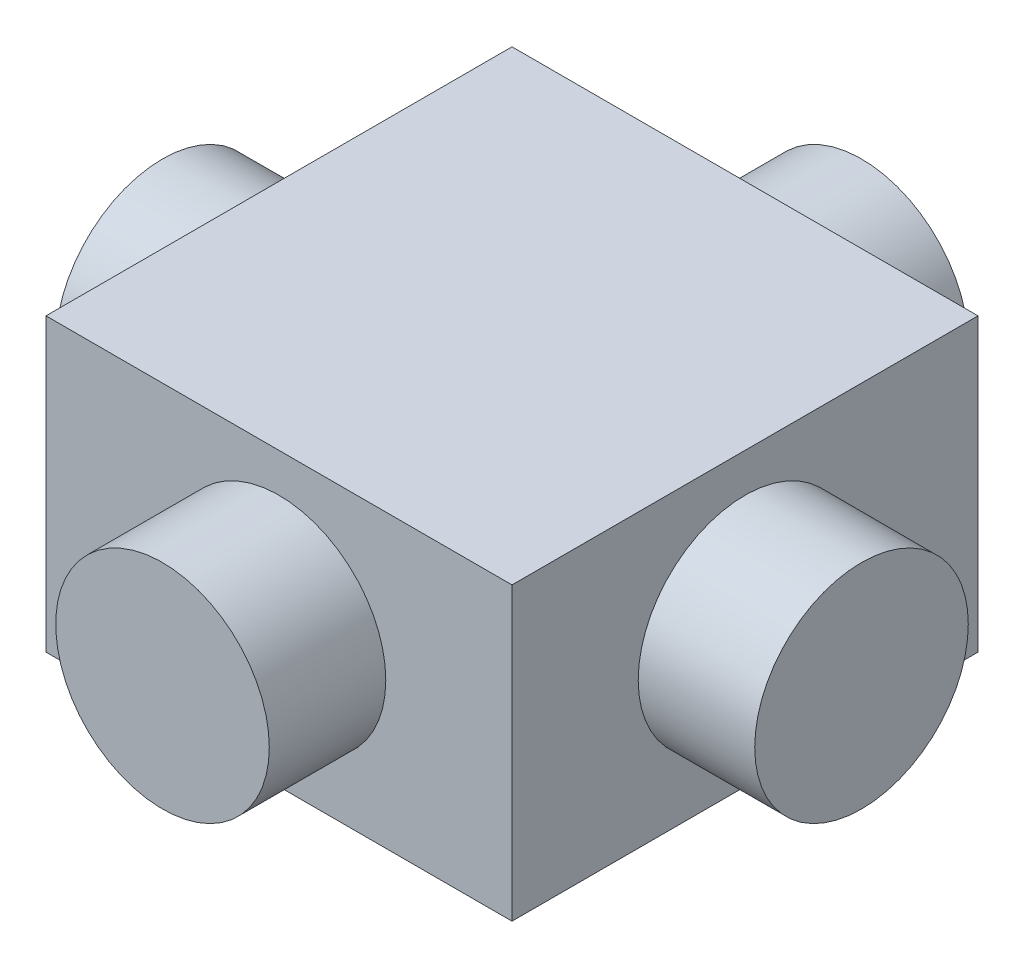
ISO-10303-21;
HEADER;
FILE_DESCRIPTION(('STEP AP214'),'2;1');
FILE_NAME('part.step','',(''),(''),'','','');
FILE_SCHEMA(('AUTOMOTIVE_DESIGN { 1 0 10303 214 1 1 1 1 }'));
ENDSEC;
DATA;
#1=APPLICATION_CONTEXT('core data for automotive mechanical design processes');
#2=APPLICATION_PROTOCOL_DEFINITION('international standard','automotive_design',2000,#1);
#3=PRODUCT_CONTEXT('',#1,'mechanical');
#4=PRODUCT('Part','Part','',(#3));
#5=PRODUCT_RELATED_PRODUCT_CATEGORY('part','',(#4));
#6=PRODUCT_DEFINITION_FORMATION('','',#4);
#7=PRODUCT_DEFINITION_CONTEXT('part definition',#1,'design');
#8=PRODUCT_DEFINITION('design','',#6,#7);
#9=PRODUCT_DEFINITION_SHAPE('','',#8);
#10=(LENGTH_UNIT() NAMED_UNIT(*) SI_UNIT(.MILLI.,.METRE.));
#11=(NAMED_UNIT(*) PLANE_ANGLE_UNIT() SI_UNIT($,.RADIAN.));
#12=(NAMED_UNIT(*) SI_UNIT($,.STERADIAN.) SOLID_ANGLE_UNIT());
#13=UNCERTAINTY_MEASURE_WITH_UNIT(LENGTH_MEASURE(1.E-05),#10,'distance_accuracy_value','');
#14=(GEOMETRIC_REPRESENTATION_CONTEXT(3) GLOBAL_UNCERTAINTY_ASSIGNED_CONTEXT((#13)) GLOBAL_UNIT_ASSIGNED_CONTEXT((#10,
#11,#12)) REPRESENTATION_CONTEXT('',''));
#15=CARTESIAN_POINT('',(0.,0.,0.));
#16=DIRECTION('',(0.,0.,1.));
#17=DIRECTION('',(1.,0.,0.));
#18=AXIS2_PLACEMENT_3D('',#15,#16,#17);
#19=CARTESIAN_POINT('',(0.,0.,3.6));
#20=DIRECTION('',(0.,0.,-1.));
#21=DIRECTION('',(-1.,0.,0.));
#22=AXIS2_PLACEMENT_3D('',#19,#20,#21);
#23=CYLINDRICAL_SURFACE('',#22,1.1);
#24=CARTESIAN_POINT('',(0.,0.,2.4));
#25=DIRECTION('',(0.,0.,1.));
#26=DIRECTION('',(1.,0.,0.));
#27=AXIS2_PLACEMENT_3D('',#24,#25,#26);
#28=CIRCLE('',#27,1.1);
#29=CARTESIAN_POINT('',(1.1,0.,2.4));
#30=VERTEX_POINT('',#29);
#31=EDGE_CURVE('E49',#30,#30,#28,.T.);
#32=ORIENTED_EDGE('',*,*,#31,.T.);
#33=EDGE_LOOP('',(#32));
#34=FACE_BOUND('',#33,.T.);
#35=CARTESIAN_POINT('',(0.,0.,3.6));
#36=DIRECTION('',(0.,0.,1.));
#37=DIRECTION('',(1.,0.,0.));
#38=AXIS2_PLACEMENT_3D('',#35,#36,#37);
#39=CIRCLE('',#38,1.1);
#40=CARTESIAN_POINT('',(1.1,0.,3.6));
#41=VERTEX_POINT('',#40);
#42=EDGE_CURVE('E148',#41,#41,#39,.T.);
#43=ORIENTED_EDGE('',*,*,#42,.F.);
#44=EDGE_LOOP('',(#43));
#45=FACE_BOUND('',#44,.T.);
#46=ADVANCED_FACE('F45',(#34,#45),#23,.T.);
#47=CARTESIAN_POINT('',(0.,0.,3.6));
#48=DIRECTION('',(0.,0.,1.));
#49=DIRECTION('',(1.,0.,0.));
#50=AXIS2_PLACEMENT_3D('',#47,#48,#49);
#51=PLANE('',#50);
#52=ORIENTED_EDGE('',*,*,#42,.T.);
#53=EDGE_LOOP('',(#52));
#54=FACE_BOUND('',#53,.T.);
#55=ADVANCED_FACE('F169',(#54),#51,.T.);
#56=CARTESIAN_POINT('',(0.,1.5,2.4));
#57=DIRECTION('',(0.,0.,1.));
#58=DIRECTION('',(1.,0.,0.));
#59=AXIS2_PLACEMENT_3D('',#56,#57,#58);
#60=PLANE('',#59);
#61=ORIENTED_EDGE('',*,*,#31,.F.);
#62=EDGE_LOOP('',(#61));
#63=FACE_BOUND('',#62,.T.);
#64=DIRECTION('',(-1.,0.,0.));
#65=VECTOR('',#64,1.);
#66=CARTESIAN_POINT('',(0.,-1.5,2.4));
#67=LINE('',#66,#65);
#68=CARTESIAN_POINT('',(2.40000000000001,-1.5,2.4));
#69=VERTEX_POINT('',#68);
#70=CARTESIAN_POINT('',(-2.40000000000001,-1.5,2.4));
#71=VERTEX_POINT('',#70);
#72=EDGE_CURVE('E120',#69,#71,#67,.T.);
#73=ORIENTED_EDGE('',*,*,#72,.F.);
#74=DIRECTION('',(0.,-1.,0.));
#75=VECTOR('',#74,1.);
#76=CARTESIAN_POINT('',(2.40000000000001,1.5,2.4));
#77=LINE('',#76,#75);
#78=CARTESIAN_POINT('',(2.40000000000001,1.5,2.4));
#79=VERTEX_POINT('',#78);
#80=EDGE_CURVE('E88',#79,#69,#77,.T.);
#81=ORIENTED_EDGE('',*,*,#80,.F.);
#82=DIRECTION('',(-1.,0.,0.));
#83=VECTOR('',#82,1.);
#84=CARTESIAN_POINT('',(0.,1.5,2.4));
#85=LINE('',#84,#83);
#86=CARTESIAN_POINT('',(-2.40000000000001,1.5,2.4));
#87=VERTEX_POINT('',#86);
#88=EDGE_CURVE('E99',#79,#87,#85,.T.);
#89=ORIENTED_EDGE('',*,*,#88,.T.);
#90=DIRECTION('',(0.,-1.,0.));
#91=VECTOR('',#90,1.);
#92=CARTESIAN_POINT('',(-2.40000000000001,1.5,2.4));
#93=LINE('',#92,#91);
#94=EDGE_CURVE('E65',#87,#71,#93,.T.);
#95=ORIENTED_EDGE('',*,*,#94,.T.);
#96=EDGE_LOOP('',(#73,#81,#89,#95));
#97=FACE_BOUND('',#96,.T.);
#98=ADVANCED_FACE('F167',(#63,#97),#60,.T.);
#99=CARTESIAN_POINT('',(2.40000000000001,1.5,0.));
#100=DIRECTION('',(-1.,0.,0.));
#101=DIRECTION('',(0.,0.,1.));
#102=AXIS2_PLACEMENT_3D('',#99,#100,#101);
#103=PLANE('',#102);
#104=CARTESIAN_POINT('',(2.40000000000001,0.,0.));
#105=DIRECTION('',(-1.,0.,0.));
#106=DIRECTION('',(0.,0.,1.));
#107=AXIS2_PLACEMENT_3D('',#104,#105,#106);
#108=CIRCLE('',#107,1.1);
#109=CARTESIAN_POINT('',(2.40000000000001,0.,1.09999999999999));
#110=VERTEX_POINT('',#109);
#111=EDGE_CURVE('E56',#110,#110,#108,.T.);
#112=ORIENTED_EDGE('',*,*,#111,.T.);
#113=EDGE_LOOP('',(#112));
#114=FACE_BOUND('',#113,.T.);
#115=DIRECTION('',(0.,0.,-1.));
#116=VECTOR('',#115,1.);
#117=CARTESIAN_POINT('',(2.40000000000001,-1.5,0.));
#118=LINE('',#117,#116);
#119=CARTESIAN_POINT('',(2.40000000000001,-1.5,-2.4));
#120=VERTEX_POINT('',#119);
#121=EDGE_CURVE('E107',#69,#120,#118,.T.);
#122=ORIENTED_EDGE('',*,*,#121,.T.);
#123=DIRECTION('',(0.,-1.,0.));
#124=VECTOR('',#123,1.);
#125=CARTESIAN_POINT('',(2.40000000000001,1.5,-2.4));
#126=LINE('',#125,#124);
#127=CARTESIAN_POINT('',(2.40000000000001,1.5,-2.4));
#128=VERTEX_POINT('',#127);
#129=EDGE_CURVE('E104',#128,#120,#126,.T.);
#130=ORIENTED_EDGE('',*,*,#129,.F.);
#131=DIRECTION('',(0.,0.,-1.));
#132=VECTOR('',#131,1.);
#133=CARTESIAN_POINT('',(2.40000000000001,1.5,0.));
#134=LINE('',#133,#132);
#135=EDGE_CURVE('E93',#79,#128,#134,.T.);
#136=ORIENTED_EDGE('',*,*,#135,.F.);
#137=ORIENTED_EDGE('',*,*,#80,.T.);
#138=EDGE_LOOP('',(#122,#130,#136,#137));
#139=FACE_BOUND('',#138,.T.);
#140=ADVANCED_FACE('F105',(#114,#139),#103,.F.);
#141=CARTESIAN_POINT('',(0.,1.5,-2.4));
#142=DIRECTION('',(0.,0.,1.));
#143=DIRECTION('',(1.,0.,0.));
#144=AXIS2_PLACEMENT_3D('',#141,#142,#143);
#145=PLANE('',#144);
#146=CARTESIAN_POINT('',(0.,0.,-2.4));
#147=DIRECTION('',(0.,0.,1.));
#148=DIRECTION('',(1.,0.,0.));
#149=AXIS2_PLACEMENT_3D('',#146,#147,#148);
#150=CIRCLE('',#149,1.1);
#151=CARTESIAN_POINT('',(1.1,0.,-2.4));
#152=VERTEX_POINT('',#151);
#153=EDGE_CURVE('E11',#152,#152,#150,.T.);
#154=ORIENTED_EDGE('',*,*,#153,.T.);
#155=EDGE_LOOP('',(#154));
#156=FACE_BOUND('',#155,.T.);
#157=DIRECTION('',(-1.,0.,0.));
#158=VECTOR('',#157,1.);
#159=CARTESIAN_POINT('',(0.,-1.5,-2.4));
#160=LINE('',#159,#158);
#161=CARTESIAN_POINT('',(-2.40000000000001,-1.5,-2.4));
#162=VERTEX_POINT('',#161);
#163=EDGE_CURVE('E125',#120,#162,#160,.T.);
#164=ORIENTED_EDGE('',*,*,#163,.T.);
#165=DIRECTION('',(0.,-1.,0.));
#166=VECTOR('',#165,1.);
#167=CARTESIAN_POINT('',(-2.40000000000001,1.5,-2.4));
#168=LINE('',#167,#166);
#169=CARTESIAN_POINT('',(-2.40000000000001,1.5,-2.4));
#170=VERTEX_POINT('',#169);
#171=EDGE_CURVE('E80',#170,#162,#168,.T.);
#172=ORIENTED_EDGE('',*,*,#171,.F.);
#173=DIRECTION('',(-1.,0.,0.));
#174=VECTOR('',#173,1.);
#175=CARTESIAN_POINT('',(0.,1.5,-2.4));
#176=LINE('',#175,#174);
#177=EDGE_CURVE('E98',#128,#170,#176,.T.);
#178=ORIENTED_EDGE('',*,*,#177,.F.);
#179=ORIENTED_EDGE('',*,*,#129,.T.);
#180=EDGE_LOOP('',(#164,#172,#178,#179));
#181=FACE_BOUND('',#180,.T.);
#182=ADVANCED_FACE('F112',(#156,#181),#145,.F.);
#183=CARTESIAN_POINT('',(-2.40000000000001,1.5,0.));
#184=DIRECTION('',(-1.,0.,0.));
#185=DIRECTION('',(0.,0.,1.));
#186=AXIS2_PLACEMENT_3D('',#183,#184,#185);
#187=PLANE('',#186);
#188=CARTESIAN_POINT('',(-2.40000000000001,0.,0.));
#189=DIRECTION('',(-1.,0.,0.));
#190=DIRECTION('',(0.,0.,1.));
#191=AXIS2_PLACEMENT_3D('',#188,#189,#190);
#192=CIRCLE('',#191,1.1);
#193=CARTESIAN_POINT('',(-2.40000000000001,0.,1.10000000000001));
#194=VERTEX_POINT('',#193);
#195=EDGE_CURVE('E138',#194,#194,#192,.T.);
#196=ORIENTED_EDGE('',*,*,#195,.F.);
#197=EDGE_LOOP('',(#196));
#198=FACE_BOUND('',#197,.T.);
#199=DIRECTION('',(0.,0.,-1.));
#200=VECTOR('',#199,1.);
#201=CARTESIAN_POINT('',(-2.40000000000001,-1.5,0.));
#202=LINE('',#201,#200);
#203=EDGE_CURVE('E128',#71,#162,#202,.T.);
#204=ORIENTED_EDGE('',*,*,#203,.F.);
#205=ORIENTED_EDGE('',*,*,#94,.F.);
#206=DIRECTION('',(0.,0.,-1.));
#207=VECTOR('',#206,1.);
#208=CARTESIAN_POINT('',(-2.40000000000001,1.5,0.));
#209=LINE('',#208,#207);
#210=EDGE_CURVE('E114',#87,#170,#209,.T.);
#211=ORIENTED_EDGE('',*,*,#210,.T.);
#212=ORIENTED_EDGE('',*,*,#171,.T.);
#213=EDGE_LOOP('',(#204,#205,#211,#212));
#214=FACE_BOUND('',#213,.T.);
#215=ADVANCED_FACE('F173',(#198,#214),#187,.T.);
#216=CARTESIAN_POINT('',(0.,1.5,0.));
#217=DIRECTION('',(0.,1.,0.));
#218=DIRECTION('',(0.,0.,1.));
#219=AXIS2_PLACEMENT_3D('',#216,#217,#218);
#220=PLANE('',#219);
#221=ORIENTED_EDGE('',*,*,#88,.F.);
#222=ORIENTED_EDGE('',*,*,#135,.T.);
#223=ORIENTED_EDGE('',*,*,#177,.T.);
#224=ORIENTED_EDGE('',*,*,#210,.F.);
#225=EDGE_LOOP('',(#221,#222,#223,#224));
#226=FACE_BOUND('',#225,.T.);
#227=ADVANCED_FACE('F95',(#226),#220,.T.);
#228=CARTESIAN_POINT('',(0.,-1.5,0.));
#229=DIRECTION('',(0.,1.,0.));
#230=DIRECTION('',(0.,0.,1.));
#231=AXIS2_PLACEMENT_3D('',#228,#229,#230);
#232=PLANE('',#231);
#233=ORIENTED_EDGE('',*,*,#72,.T.);
#234=ORIENTED_EDGE('',*,*,#203,.T.);
#235=ORIENTED_EDGE('',*,*,#163,.F.);
#236=ORIENTED_EDGE('',*,*,#121,.F.);
#237=EDGE_LOOP('',(#233,#234,#235,#236));
#238=FACE_BOUND('',#237,.T.);
#239=ADVANCED_FACE('F172',(#238),#232,.F.);
#240=CARTESIAN_POINT('',(3.6,0.,0.));
#241=DIRECTION('',(1.,0.,0.));
#242=DIRECTION('',(0.,0.,-1.));
#243=AXIS2_PLACEMENT_3D('',#240,#241,#242);
#244=PLANE('',#243);
#245=CARTESIAN_POINT('',(3.6,0.,0.));
#246=DIRECTION('',(1.,0.,0.));
#247=DIRECTION('',(0.,0.,-1.));
#248=AXIS2_PLACEMENT_3D('',#245,#246,#247);
#249=CIRCLE('',#248,1.1);
#250=CARTESIAN_POINT('',(3.6,0.,-1.10000000000001));
#251=VERTEX_POINT('',#250);
#252=EDGE_CURVE('E139',#251,#251,#249,.T.);
#253=ORIENTED_EDGE('',*,*,#252,.T.);
#254=EDGE_LOOP('',(#253));
#255=FACE_BOUND('',#254,.T.);
#256=ADVANCED_FACE('F210',(#255),#244,.T.);
#257=CARTESIAN_POINT('',(3.6,0.,0.));
#258=DIRECTION('',(-1.,0.,0.));
#259=DIRECTION('',(0.,0.,1.));
#260=AXIS2_PLACEMENT_3D('',#257,#258,#259);
#261=CYLINDRICAL_SURFACE('',#260,1.1);
#262=ORIENTED_EDGE('',*,*,#252,.F.);
#263=EDGE_LOOP('',(#262));
#264=FACE_BOUND('',#263,.T.);
#265=ORIENTED_EDGE('',*,*,#111,.F.);
#266=EDGE_LOOP('',(#265));
#267=FACE_BOUND('',#266,.T.);
#268=ADVANCED_FACE('F202',(#264,#267),#261,.T.);
#269=CARTESIAN_POINT('',(0.,0.,-3.6));
#270=DIRECTION('',(0.,0.,1.));
#271=DIRECTION('',(1.,0.,0.));
#272=AXIS2_PLACEMENT_3D('',#269,#270,#271);
#273=PLANE('',#272);
#274=CARTESIAN_POINT('',(0.,0.,-3.6));
#275=DIRECTION('',(0.,0.,1.));
#276=DIRECTION('',(1.,0.,0.));
#277=AXIS2_PLACEMENT_3D('',#274,#275,#276);
#278=CIRCLE('',#277,1.1);
#279=CARTESIAN_POINT('',(1.1,0.,-3.6));
#280=VERTEX_POINT('',#279);
#281=EDGE_CURVE('E143',#280,#280,#278,.T.);
#282=ORIENTED_EDGE('',*,*,#281,.F.);
#283=EDGE_LOOP('',(#282));
#284=FACE_BOUND('',#283,.T.);
#285=ADVANCED_FACE('F193',(#284),#273,.F.);
#286=ORIENTED_EDGE('',*,*,#281,.T.);
#287=EDGE_LOOP('',(#286));
#288=FACE_BOUND('',#287,.T.);
#289=ORIENTED_EDGE('',*,*,#153,.F.);
#290=EDGE_LOOP('',(#289));
#291=FACE_BOUND('',#290,.T.);
#292=ADVANCED_FACE('F47',(#288,#291),#23,.T.);
#293=CARTESIAN_POINT('',(-3.6,0.,0.));
#294=DIRECTION('',(1.,0.,0.));
#295=DIRECTION('',(0.,0.,-1.));
#296=AXIS2_PLACEMENT_3D('',#293,#294,#295);
#297=PLANE('',#296);
#298=CARTESIAN_POINT('',(-3.6,0.,0.));
#299=DIRECTION('',(1.,0.,0.));
#300=DIRECTION('',(0.,0.,-1.));
#301=AXIS2_PLACEMENT_3D('',#298,#299,#300);
#302=CIRCLE('',#301,1.1);
#303=CARTESIAN_POINT('',(-3.6,0.,-1.09999999999999));
#304=VERTEX_POINT('',#303);
#305=EDGE_CURVE('E144',#304,#304,#302,.T.);
#306=ORIENTED_EDGE('',*,*,#305,.F.);
#307=EDGE_LOOP('',(#306));
#308=FACE_BOUND('',#307,.T.);
#309=ADVANCED_FACE('F192',(#308),#297,.F.);
#310=ORIENTED_EDGE('',*,*,#195,.T.);
#311=EDGE_LOOP('',(#310));
#312=FACE_BOUND('',#311,.T.);
#313=ORIENTED_EDGE('',*,*,#305,.T.);
#314=EDGE_LOOP('',(#313));
#315=FACE_BOUND('',#314,.T.);
#316=ADVANCED_FACE('F199',(#312,#315),#261,.T.);
#317=CLOSED_SHELL('',(#46,#55,#98,#140,#182,#215,#227,#239,#256,#268,#285,#292,#309,#316));
#318=MANIFOLD_SOLID_BREP('B2',#317);
#319=ADVANCED_BREP_SHAPE_REPRESENTATION('',(#18,#318),#14);
#320=SHAPE_DEFINITION_REPRESENTATION(#9,#319);
ENDSEC;
END-ISO-10303-21;
